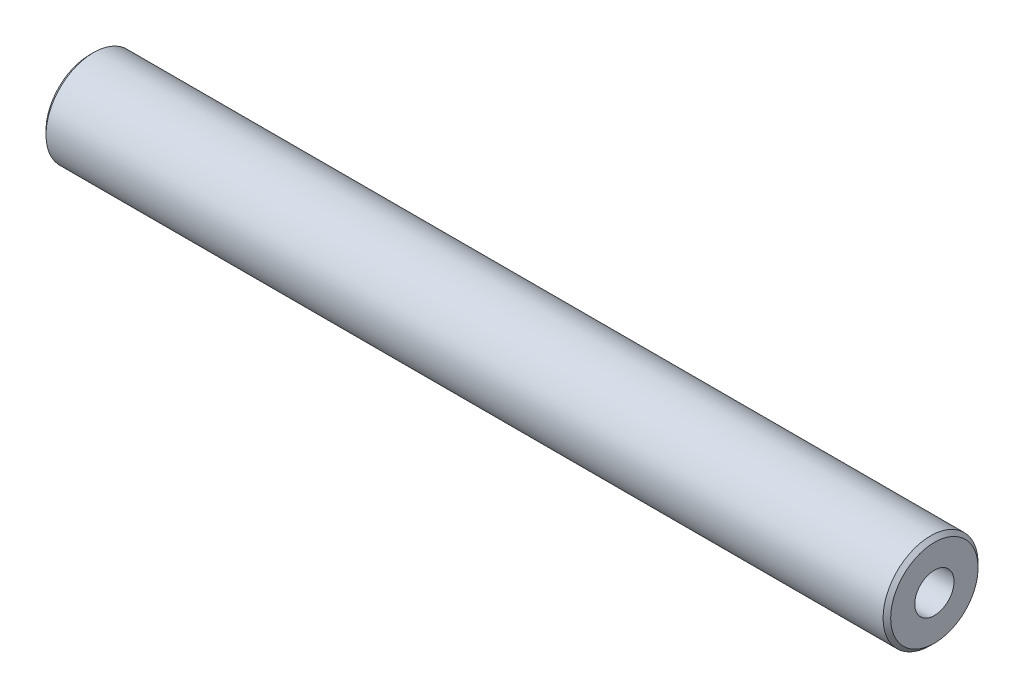
ISO-10303-21;
HEADER;
FILE_DESCRIPTION(('STEP AP214'),'2;1');
FILE_NAME('part.step','',(''),(''),'','','');
FILE_SCHEMA(('AUTOMOTIVE_DESIGN { 1 0 10303 214 1 1 1 1 }'));
ENDSEC;
DATA;
#1=APPLICATION_CONTEXT('core data for automotive mechanical design processes');
#2=APPLICATION_PROTOCOL_DEFINITION('international standard','automotive_design',2000,#1);
#3=PRODUCT_CONTEXT('',#1,'mechanical');
#4=PRODUCT('Part','Part','',(#3));
#5=PRODUCT_RELATED_PRODUCT_CATEGORY('part','',(#4));
#6=PRODUCT_DEFINITION_FORMATION('','',#4);
#7=PRODUCT_DEFINITION_CONTEXT('part definition',#1,'design');
#8=PRODUCT_DEFINITION('design','',#6,#7);
#9=PRODUCT_DEFINITION_SHAPE('','',#8);
#10=(LENGTH_UNIT() NAMED_UNIT(*) SI_UNIT(.MILLI.,.METRE.));
#11=(NAMED_UNIT(*) PLANE_ANGLE_UNIT() SI_UNIT($,.RADIAN.));
#12=(NAMED_UNIT(*) SI_UNIT($,.STERADIAN.) SOLID_ANGLE_UNIT());
#13=UNCERTAINTY_MEASURE_WITH_UNIT(LENGTH_MEASURE(1.E-05),#10,'distance_accuracy_value','');
#14=(GEOMETRIC_REPRESENTATION_CONTEXT(3) GLOBAL_UNCERTAINTY_ASSIGNED_CONTEXT((#13)) GLOBAL_UNIT_ASSIGNED_CONTEXT((#10,
#11,#12)) REPRESENTATION_CONTEXT('',''));
#15=CARTESIAN_POINT('',(0.,0.,0.));
#16=DIRECTION('',(0.,0.,1.));
#17=DIRECTION('',(1.,0.,0.));
#18=AXIS2_PLACEMENT_3D('',#15,#16,#17);
#19=CARTESIAN_POINT('',(0.,5.,0.));
#20=DIRECTION('',(1.,0.,0.));
#21=DIRECTION('',(0.,0.,-1.));
#22=AXIS2_PLACEMENT_3D('',#19,#20,#21);
#23=PLANE('',#22);
#24=CARTESIAN_POINT('',(0.,0.,0.));
#25=DIRECTION('',(-1.,0.,0.));
#26=DIRECTION('',(0.,0.,1.));
#27=AXIS2_PLACEMENT_3D('',#24,#25,#26);
#28=CIRCLE('',#27,2.067);
#29=CARTESIAN_POINT('',(0.,0.,2.067));
#30=VERTEX_POINT('',#29);
#31=EDGE_CURVE('E65',#30,#30,#28,.T.);
#32=ORIENTED_EDGE('',*,*,#31,.F.);
#33=EDGE_LOOP('',(#32));
#34=FACE_BOUND('',#33,.T.);
#35=CARTESIAN_POINT('',(0.,0.,0.));
#36=DIRECTION('',(1.,0.,0.));
#37=DIRECTION('',(0.,0.,-1.));
#38=AXIS2_PLACEMENT_3D('',#35,#36,#37);
#39=CIRCLE('',#38,4.60000000000003);
#40=CARTESIAN_POINT('',(0.,0.,-4.60000000000003));
#41=VERTEX_POINT('',#40);
#42=EDGE_CURVE('E11',#41,#41,#39,.F.);
#43=ORIENTED_EDGE('',*,*,#42,.T.);
#44=EDGE_LOOP('',(#43));
#45=FACE_BOUND('',#44,.T.);
#46=ADVANCED_FACE('F41',(#34,#45),#23,.F.);
#47=CARTESIAN_POINT('',(88.9,5.,0.));
#48=DIRECTION('',(-1.,0.,0.));
#49=DIRECTION('',(0.,0.,1.));
#50=AXIS2_PLACEMENT_3D('',#47,#48,#49);
#51=PLANE('',#50);
#52=CARTESIAN_POINT('',(88.9,0.,0.));
#53=DIRECTION('',(1.,0.,0.));
#54=DIRECTION('',(0.,0.,-1.));
#55=AXIS2_PLACEMENT_3D('',#52,#53,#54);
#56=CIRCLE('',#55,2.067);
#57=CARTESIAN_POINT('',(88.9,0.,-2.067));
#58=VERTEX_POINT('',#57);
#59=EDGE_CURVE('E66',#58,#58,#56,.T.);
#60=ORIENTED_EDGE('',*,*,#59,.F.);
#61=EDGE_LOOP('',(#60));
#62=FACE_BOUND('',#61,.T.);
#63=CARTESIAN_POINT('',(88.9,0.,0.));
#64=DIRECTION('',(-1.,0.,0.));
#65=DIRECTION('',(0.,0.,1.));
#66=AXIS2_PLACEMENT_3D('',#63,#64,#65);
#67=CIRCLE('',#66,4.60000000000002);
#68=CARTESIAN_POINT('',(88.9,0.,4.60000000000002));
#69=VERTEX_POINT('',#68);
#70=EDGE_CURVE('E49',#69,#69,#67,.F.);
#71=ORIENTED_EDGE('',*,*,#70,.T.);
#72=EDGE_LOOP('',(#71));
#73=FACE_BOUND('',#72,.T.);
#74=ADVANCED_FACE('F84',(#62,#73),#51,.F.);
#75=CARTESIAN_POINT('',(0.,0.,0.));
#76=DIRECTION('',(-1.,0.,0.));
#77=DIRECTION('',(0.,0.,1.));
#78=AXIS2_PLACEMENT_3D('',#75,#76,#77);
#79=CYLINDRICAL_SURFACE('',#78,5.);
#80=CARTESIAN_POINT('',(88.5,0.,0.));
#81=DIRECTION('',(-1.,0.,0.));
#82=DIRECTION('',(0.,0.,1.));
#83=AXIS2_PLACEMENT_3D('',#80,#81,#82);
#84=CIRCLE('',#83,5.);
#85=CARTESIAN_POINT('',(88.5,0.,5.));
#86=VERTEX_POINT('',#85);
#87=EDGE_CURVE('E79',#86,#86,#84,.T.);
#88=ORIENTED_EDGE('',*,*,#87,.T.);
#89=EDGE_LOOP('',(#88));
#90=FACE_BOUND('',#89,.T.);
#91=CARTESIAN_POINT('',(0.399999999999978,0.,0.));
#92=DIRECTION('',(1.,0.,0.));
#93=DIRECTION('',(0.,0.,-1.));
#94=AXIS2_PLACEMENT_3D('',#91,#92,#93);
#95=CIRCLE('',#94,5.);
#96=CARTESIAN_POINT('',(0.399999999999978,0.,-5.));
#97=VERTEX_POINT('',#96);
#98=EDGE_CURVE('E76',#97,#97,#95,.T.);
#99=ORIENTED_EDGE('',*,*,#98,.T.);
#100=EDGE_LOOP('',(#99));
#101=FACE_BOUND('',#100,.T.);
#102=ADVANCED_FACE('F89',(#90,#101),#79,.T.);
#103=CARTESIAN_POINT('',(88.5,0.,0.));
#104=DIRECTION('',(-1.,0.,0.));
#105=DIRECTION('',(0.,0.,1.));
#106=AXIS2_PLACEMENT_3D('',#103,#104,#105);
#107=CONICAL_SURFACE('',#106,5.,0.78539816339746);
#108=ORIENTED_EDGE('',*,*,#70,.F.);
#109=EDGE_LOOP('',(#108));
#110=FACE_BOUND('',#109,.T.);
#111=ORIENTED_EDGE('',*,*,#87,.F.);
#112=EDGE_LOOP('',(#111));
#113=FACE_BOUND('',#112,.T.);
#114=ADVANCED_FACE('F86',(#110,#113),#107,.T.);
#115=CARTESIAN_POINT('',(0.,0.,0.));
#116=DIRECTION('',(1.,0.,0.));
#117=DIRECTION('',(0.,0.,-1.));
#118=AXIS2_PLACEMENT_3D('',#115,#116,#117);
#119=CONICAL_SURFACE('',#118,4.60000000000003,0.785398163397432);
#120=ORIENTED_EDGE('',*,*,#98,.F.);
#121=EDGE_LOOP('',(#120));
#122=FACE_BOUND('',#121,.T.);
#123=ORIENTED_EDGE('',*,*,#42,.F.);
#124=EDGE_LOOP('',(#123));
#125=FACE_BOUND('',#124,.T.);
#126=ADVANCED_FACE('F43',(#122,#125),#119,.T.);
#127=CARTESIAN_POINT('',(12.4,0.,0.));
#128=DIRECTION('',(-1.,0.,0.));
#129=DIRECTION('',(0.,0.,1.));
#130=AXIS2_PLACEMENT_3D('',#127,#128,#129);
#131=CONICAL_SURFACE('',#130,2.067,1.02974425867665);
#132=CARTESIAN_POINT('',(13.64197889953,0.,0.));
#133=VERTEX_POINT('',#132);
#134=VERTEX_LOOP('',#133);
#135=FACE_BOUND('',#134,.T.);
#136=CARTESIAN_POINT('',(12.4,0.,0.));
#137=DIRECTION('',(-1.,0.,0.));
#138=DIRECTION('',(0.,0.,1.));
#139=AXIS2_PLACEMENT_3D('',#136,#137,#138);
#140=CIRCLE('',#139,2.067);
#141=CARTESIAN_POINT('',(12.4,0.,2.067));
#142=VERTEX_POINT('',#141);
#143=EDGE_CURVE('E69',#142,#142,#140,.T.);
#144=ORIENTED_EDGE('',*,*,#143,.T.);
#145=EDGE_LOOP('',(#144));
#146=FACE_BOUND('',#145,.T.);
#147=ADVANCED_FACE('F99',(#135,#146),#131,.F.);
#148=CARTESIAN_POINT('',(0.,0.,0.));
#149=DIRECTION('',(-1.,0.,0.));
#150=DIRECTION('',(0.,0.,1.));
#151=AXIS2_PLACEMENT_3D('',#148,#149,#150);
#152=CYLINDRICAL_SURFACE('',#151,2.067);
#153=ORIENTED_EDGE('',*,*,#143,.F.);
#154=EDGE_LOOP('',(#153));
#155=FACE_BOUND('',#154,.T.);
#156=ORIENTED_EDGE('',*,*,#31,.T.);
#157=EDGE_LOOP('',(#156));
#158=FACE_BOUND('',#157,.T.);
#159=ADVANCED_FACE('F59',(#155,#158),#152,.F.);
#160=CARTESIAN_POINT('',(76.5,0.,0.));
#161=DIRECTION('',(1.,0.,0.));
#162=DIRECTION('',(0.,0.,-1.));
#163=AXIS2_PLACEMENT_3D('',#160,#161,#162);
#164=CONICAL_SURFACE('',#163,2.067,1.02974425867665);
#165=CARTESIAN_POINT('',(75.25802110047,0.,0.));
#166=VERTEX_POINT('',#165);
#167=VERTEX_LOOP('',#166);
#168=FACE_BOUND('',#167,.T.);
#169=CARTESIAN_POINT('',(76.5,0.,0.));
#170=DIRECTION('',(1.,0.,0.));
#171=DIRECTION('',(0.,0.,-1.));
#172=AXIS2_PLACEMENT_3D('',#169,#170,#171);
#173=CIRCLE('',#172,2.067);
#174=CARTESIAN_POINT('',(76.5,0.,-2.067));
#175=VERTEX_POINT('',#174);
#176=EDGE_CURVE('E63',#175,#175,#173,.T.);
#177=ORIENTED_EDGE('',*,*,#176,.T.);
#178=EDGE_LOOP('',(#177));
#179=FACE_BOUND('',#178,.T.);
#180=ADVANCED_FACE('F55',(#168,#179),#164,.F.);
#181=CARTESIAN_POINT('',(88.9,0.,0.));
#182=DIRECTION('',(1.,0.,0.));
#183=DIRECTION('',(0.,0.,-1.));
#184=AXIS2_PLACEMENT_3D('',#181,#182,#183);
#185=CYLINDRICAL_SURFACE('',#184,2.067);
#186=ORIENTED_EDGE('',*,*,#176,.F.);
#187=EDGE_LOOP('',(#186));
#188=FACE_BOUND('',#187,.T.);
#189=ORIENTED_EDGE('',*,*,#59,.T.);
#190=EDGE_LOOP('',(#189));
#191=FACE_BOUND('',#190,.T.);
#192=ADVANCED_FACE('F58',(#188,#191),#185,.F.);
#193=CLOSED_SHELL('',(#46,#74,#102,#114,#126,#147,#159,#180,#192));
#194=MANIFOLD_SOLID_BREP('B2',#193);
#195=ADVANCED_BREP_SHAPE_REPRESENTATION('',(#18,#194),#14);
#196=SHAPE_DEFINITION_REPRESENTATION(#9,#195);
ENDSEC;
END-ISO-10303-21;
